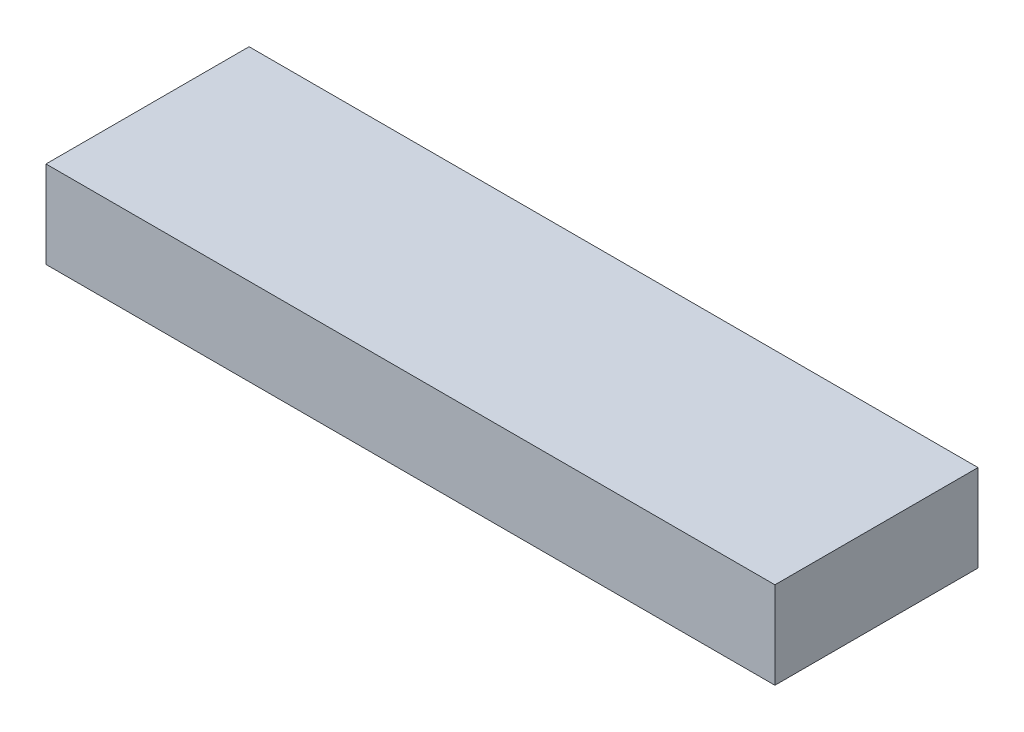
ISO-10303-21;
HEADER;
FILE_DESCRIPTION(('STEP AP214'),'2;1');
FILE_NAME('part.step','',(''),(''),'','','');
FILE_SCHEMA(('AUTOMOTIVE_DESIGN { 1 0 10303 214 1 1 1 1 }'));
ENDSEC;
DATA;
#1=APPLICATION_CONTEXT('core data for automotive mechanical design processes');
#2=APPLICATION_PROTOCOL_DEFINITION('international standard','automotive_design',2000,#1);
#3=PRODUCT_CONTEXT('',#1,'mechanical');
#4=PRODUCT('Part','Part','',(#3));
#5=PRODUCT_RELATED_PRODUCT_CATEGORY('part','',(#4));
#6=PRODUCT_DEFINITION_FORMATION('','',#4);
#7=PRODUCT_DEFINITION_CONTEXT('part definition',#1,'design');
#8=PRODUCT_DEFINITION('design','',#6,#7);
#9=PRODUCT_DEFINITION_SHAPE('','',#8);
#10=(LENGTH_UNIT() NAMED_UNIT(*) SI_UNIT(.MILLI.,.METRE.));
#11=(NAMED_UNIT(*) PLANE_ANGLE_UNIT() SI_UNIT($,.RADIAN.));
#12=(NAMED_UNIT(*) SI_UNIT($,.STERADIAN.) SOLID_ANGLE_UNIT());
#13=UNCERTAINTY_MEASURE_WITH_UNIT(LENGTH_MEASURE(1.E-05),#10,'distance_accuracy_value','');
#14=(GEOMETRIC_REPRESENTATION_CONTEXT(3) GLOBAL_UNCERTAINTY_ASSIGNED_CONTEXT((#13)) GLOBAL_UNIT_ASSIGNED_CONTEXT((#10,
#11,#12)) REPRESENTATION_CONTEXT('',''));
#15=CARTESIAN_POINT('',(0.,0.,0.));
#16=DIRECTION('',(0.,0.,1.));
#17=DIRECTION('',(1.,0.,0.));
#18=AXIS2_PLACEMENT_3D('',#15,#16,#17);
#19=CARTESIAN_POINT('',(0.,38.1,0.));
#20=DIRECTION('',(1.,0.,0.));
#21=DIRECTION('',(0.,0.,-1.));
#22=AXIS2_PLACEMENT_3D('',#19,#20,#21);
#23=PLANE('',#22);
#24=DIRECTION('',(0.,0.,1.));
#25=VECTOR('',#24,1.);
#26=CARTESIAN_POINT('',(0.,0.,0.));
#27=LINE('',#26,#25);
#28=CARTESIAN_POINT('',(0.,0.,-88.9));
#29=VERTEX_POINT('',#28);
#30=CARTESIAN_POINT('',(0.,0.,0.));
#31=VERTEX_POINT('',#30);
#32=EDGE_CURVE('E102',#29,#31,#27,.T.);
#33=ORIENTED_EDGE('',*,*,#32,.T.);
#34=DIRECTION('',(0.,-1.,0.));
#35=VECTOR('',#34,1.);
#36=CARTESIAN_POINT('',(0.,38.1,0.));
#37=LINE('',#36,#35);
#38=CARTESIAN_POINT('',(0.,38.1,0.));
#39=VERTEX_POINT('',#38);
#40=EDGE_CURVE('E11',#39,#31,#37,.T.);
#41=ORIENTED_EDGE('',*,*,#40,.F.);
#42=DIRECTION('',(0.,0.,1.));
#43=VECTOR('',#42,1.);
#44=CARTESIAN_POINT('',(0.,38.1,0.));
#45=LINE('',#44,#43);
#46=CARTESIAN_POINT('',(0.,38.1,-88.9));
#47=VERTEX_POINT('',#46);
#48=EDGE_CURVE('E90',#47,#39,#45,.T.);
#49=ORIENTED_EDGE('',*,*,#48,.F.);
#50=DIRECTION('',(0.,-1.,0.));
#51=VECTOR('',#50,1.);
#52=CARTESIAN_POINT('',(0.,38.1,-88.9));
#53=LINE('',#52,#51);
#54=EDGE_CURVE('E98',#47,#29,#53,.T.);
#55=ORIENTED_EDGE('',*,*,#54,.T.);
#56=EDGE_LOOP('',(#33,#41,#49,#55));
#57=FACE_BOUND('',#56,.T.);
#58=ADVANCED_FACE('F39',(#57),#23,.F.);
#59=CARTESIAN_POINT('',(0.,38.1,0.));
#60=DIRECTION('',(0.,0.,-1.));
#61=DIRECTION('',(-1.,0.,0.));
#62=AXIS2_PLACEMENT_3D('',#59,#60,#61);
#63=PLANE('',#62);
#64=DIRECTION('',(1.,0.,0.));
#65=VECTOR('',#64,1.);
#66=CARTESIAN_POINT('',(0.,0.,0.));
#67=LINE('',#66,#65);
#68=CARTESIAN_POINT('',(319.0875,0.,0.));
#69=VERTEX_POINT('',#68);
#70=EDGE_CURVE('E94',#31,#69,#67,.T.);
#71=ORIENTED_EDGE('',*,*,#70,.T.);
#72=DIRECTION('',(0.,-1.,0.));
#73=VECTOR('',#72,1.);
#74=CARTESIAN_POINT('',(319.0875,38.1,0.));
#75=LINE('',#74,#73);
#76=CARTESIAN_POINT('',(319.0875,38.1,0.));
#77=VERTEX_POINT('',#76);
#78=EDGE_CURVE('E47',#77,#69,#75,.T.);
#79=ORIENTED_EDGE('',*,*,#78,.F.);
#80=DIRECTION('',(1.,0.,0.));
#81=VECTOR('',#80,1.);
#82=CARTESIAN_POINT('',(0.,38.1,0.));
#83=LINE('',#82,#81);
#84=EDGE_CURVE('E85',#39,#77,#83,.T.);
#85=ORIENTED_EDGE('',*,*,#84,.F.);
#86=ORIENTED_EDGE('',*,*,#40,.T.);
#87=EDGE_LOOP('',(#71,#79,#85,#86));
#88=FACE_BOUND('',#87,.T.);
#89=ADVANCED_FACE('F93',(#88),#63,.F.);
#90=CARTESIAN_POINT('',(319.0875,38.1,0.));
#91=DIRECTION('',(-1.,0.,0.));
#92=DIRECTION('',(0.,0.,1.));
#93=AXIS2_PLACEMENT_3D('',#90,#91,#92);
#94=PLANE('',#93);
#95=DIRECTION('',(0.,0.,-1.));
#96=VECTOR('',#95,1.);
#97=CARTESIAN_POINT('',(319.0875,0.,0.));
#98=LINE('',#97,#96);
#99=CARTESIAN_POINT('',(319.0875,0.,-88.9));
#100=VERTEX_POINT('',#99);
#101=EDGE_CURVE('E72',#69,#100,#98,.T.);
#102=ORIENTED_EDGE('',*,*,#101,.T.);
#103=DIRECTION('',(0.,-1.,0.));
#104=VECTOR('',#103,1.);
#105=CARTESIAN_POINT('',(319.0875,38.1,-88.9));
#106=LINE('',#105,#104);
#107=CARTESIAN_POINT('',(319.0875,38.1,-88.9));
#108=VERTEX_POINT('',#107);
#109=EDGE_CURVE('E95',#108,#100,#106,.T.);
#110=ORIENTED_EDGE('',*,*,#109,.F.);
#111=DIRECTION('',(0.,0.,-1.));
#112=VECTOR('',#111,1.);
#113=CARTESIAN_POINT('',(319.0875,38.1,0.));
#114=LINE('',#113,#112);
#115=EDGE_CURVE('E88',#77,#108,#114,.T.);
#116=ORIENTED_EDGE('',*,*,#115,.F.);
#117=ORIENTED_EDGE('',*,*,#78,.T.);
#118=EDGE_LOOP('',(#102,#110,#116,#117));
#119=FACE_BOUND('',#118,.T.);
#120=ADVANCED_FACE('F96',(#119),#94,.F.);
#121=CARTESIAN_POINT('',(0.,38.1,-88.9));
#122=DIRECTION('',(0.,0.,1.));
#123=DIRECTION('',(1.,0.,0.));
#124=AXIS2_PLACEMENT_3D('',#121,#122,#123);
#125=PLANE('',#124);
#126=DIRECTION('',(-1.,0.,0.));
#127=VECTOR('',#126,1.);
#128=CARTESIAN_POINT('',(0.,0.,-88.9));
#129=LINE('',#128,#127);
#130=EDGE_CURVE('E78',#100,#29,#129,.T.);
#131=ORIENTED_EDGE('',*,*,#130,.T.);
#132=ORIENTED_EDGE('',*,*,#54,.F.);
#133=DIRECTION('',(-1.,0.,0.));
#134=VECTOR('',#133,1.);
#135=CARTESIAN_POINT('',(0.,38.1,-88.9));
#136=LINE('',#135,#134);
#137=EDGE_CURVE('E55',#108,#47,#136,.T.);
#138=ORIENTED_EDGE('',*,*,#137,.F.);
#139=ORIENTED_EDGE('',*,*,#109,.T.);
#140=EDGE_LOOP('',(#131,#132,#138,#139));
#141=FACE_BOUND('',#140,.T.);
#142=ADVANCED_FACE('F109',(#141),#125,.F.);
#143=CARTESIAN_POINT('',(0.,38.1,0.));
#144=DIRECTION('',(0.,-1.,0.));
#145=DIRECTION('',(0.,0.,-1.));
#146=AXIS2_PLACEMENT_3D('',#143,#144,#145);
#147=PLANE('',#146);
#148=ORIENTED_EDGE('',*,*,#48,.T.);
#149=ORIENTED_EDGE('',*,*,#84,.T.);
#150=ORIENTED_EDGE('',*,*,#115,.T.);
#151=ORIENTED_EDGE('',*,*,#137,.T.);
#152=EDGE_LOOP('',(#148,#149,#150,#151));
#153=FACE_BOUND('',#152,.T.);
#154=ADVANCED_FACE('F86',(#153),#147,.F.);
#155=CARTESIAN_POINT('',(0.,0.,0.));
#156=DIRECTION('',(0.,-1.,0.));
#157=DIRECTION('',(0.,0.,-1.));
#158=AXIS2_PLACEMENT_3D('',#155,#156,#157);
#159=PLANE('',#158);
#160=ORIENTED_EDGE('',*,*,#32,.F.);
#161=ORIENTED_EDGE('',*,*,#130,.F.);
#162=ORIENTED_EDGE('',*,*,#101,.F.);
#163=ORIENTED_EDGE('',*,*,#70,.F.);
#164=EDGE_LOOP('',(#160,#161,#162,#163));
#165=FACE_BOUND('',#164,.T.);
#166=ADVANCED_FACE('F112',(#165),#159,.T.);
#167=CLOSED_SHELL('',(#58,#89,#120,#142,#154,#166));
#168=MANIFOLD_SOLID_BREP('B2',#167);
#169=ADVANCED_BREP_SHAPE_REPRESENTATION('',(#18,#168),#14);
#170=SHAPE_DEFINITION_REPRESENTATION(#9,#169);
ENDSEC;
END-ISO-10303-21;
